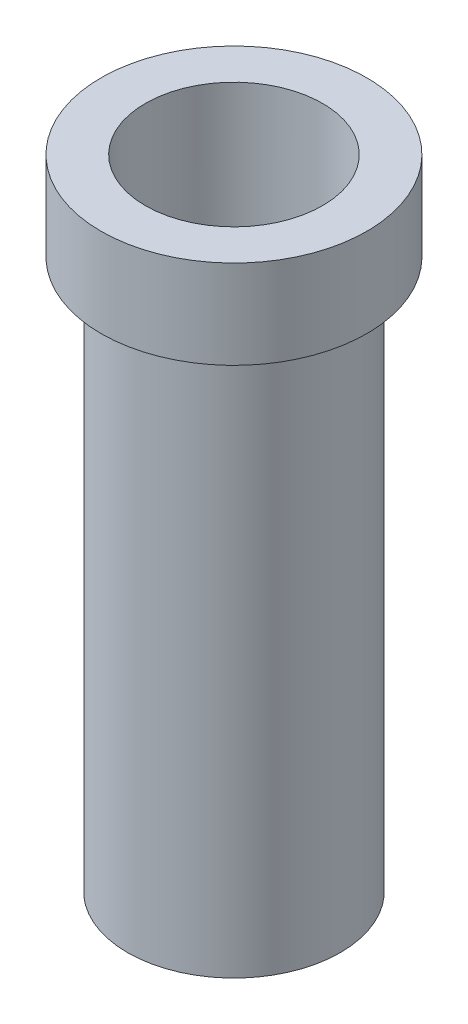
ISO-10303-21;
HEADER;
FILE_DESCRIPTION(('STEP AP214'),'2;1');
FILE_NAME('part.step','',(''),(''),'','','');
FILE_SCHEMA(('AUTOMOTIVE_DESIGN { 1 0 10303 214 1 1 1 1 }'));
ENDSEC;
DATA;
#1=APPLICATION_CONTEXT('core data for automotive mechanical design processes');
#2=APPLICATION_PROTOCOL_DEFINITION('international standard','automotive_design',2000,#1);
#3=PRODUCT_CONTEXT('',#1,'mechanical');
#4=PRODUCT('Part','Part','',(#3));
#5=PRODUCT_RELATED_PRODUCT_CATEGORY('part','',(#4));
#6=PRODUCT_DEFINITION_FORMATION('','',#4);
#7=PRODUCT_DEFINITION_CONTEXT('part definition',#1,'design');
#8=PRODUCT_DEFINITION('design','',#6,#7);
#9=PRODUCT_DEFINITION_SHAPE('','',#8);
#10=(LENGTH_UNIT() NAMED_UNIT(*) SI_UNIT(.MILLI.,.METRE.));
#11=(NAMED_UNIT(*) PLANE_ANGLE_UNIT() SI_UNIT($,.RADIAN.));
#12=(NAMED_UNIT(*) SI_UNIT($,.STERADIAN.) SOLID_ANGLE_UNIT());
#13=UNCERTAINTY_MEASURE_WITH_UNIT(LENGTH_MEASURE(1.E-05),#10,'distance_accuracy_value','');
#14=(GEOMETRIC_REPRESENTATION_CONTEXT(3) GLOBAL_UNCERTAINTY_ASSIGNED_CONTEXT((#13)) GLOBAL_UNIT_ASSIGNED_CONTEXT((#10,
#11,#12)) REPRESENTATION_CONTEXT('',''));
#15=CARTESIAN_POINT('',(0.,0.,0.));
#16=DIRECTION('',(0.,0.,1.));
#17=DIRECTION('',(1.,0.,0.));
#18=AXIS2_PLACEMENT_3D('',#15,#16,#17);
#19=CARTESIAN_POINT('',(0.,0.,0.));
#20=DIRECTION('',(0.,1.,0.));
#21=DIRECTION('',(0.,0.,1.));
#22=AXIS2_PLACEMENT_3D('',#19,#20,#21);
#23=PLANE('',#22);
#24=CARTESIAN_POINT('',(0.,0.,0.));
#25=DIRECTION('',(0.,1.,0.));
#26=DIRECTION('',(0.,0.,1.));
#27=AXIS2_PLACEMENT_3D('',#24,#25,#26);
#28=CIRCLE('',#27,7.5);
#29=CARTESIAN_POINT('',(0.,0.,7.5));
#30=VERTEX_POINT('',#29);
#31=EDGE_CURVE('E39',#30,#30,#28,.T.);
#32=ORIENTED_EDGE('',*,*,#31,.F.);
#33=EDGE_LOOP('',(#32));
#34=FACE_BOUND('',#33,.T.);
#35=CARTESIAN_POINT('',(0.,0.,0.));
#36=DIRECTION('',(0.,1.,0.));
#37=DIRECTION('',(0.,0.,1.));
#38=AXIS2_PLACEMENT_3D('',#35,#36,#37);
#39=CIRCLE('',#38,6.);
#40=CARTESIAN_POINT('',(0.,0.,6.));
#41=VERTEX_POINT('',#40);
#42=EDGE_CURVE('E10',#41,#41,#39,.F.);
#43=ORIENTED_EDGE('',*,*,#42,.F.);
#44=EDGE_LOOP('',(#43));
#45=FACE_BOUND('',#44,.T.);
#46=ADVANCED_FACE('F28',(#34,#45),#23,.F.);
#47=CARTESIAN_POINT('',(0.,5.,0.));
#48=DIRECTION('',(0.,-1.,0.));
#49=DIRECTION('',(0.,0.,-1.));
#50=AXIS2_PLACEMENT_3D('',#47,#48,#49);
#51=CYLINDRICAL_SURFACE('',#50,7.5);
#52=CARTESIAN_POINT('',(0.,5.,0.));
#53=DIRECTION('',(0.,1.,0.));
#54=DIRECTION('',(0.,0.,1.));
#55=AXIS2_PLACEMENT_3D('',#52,#53,#54);
#56=CIRCLE('',#55,7.5);
#57=CARTESIAN_POINT('',(0.,5.,7.5));
#58=VERTEX_POINT('',#57);
#59=EDGE_CURVE('E35',#58,#58,#56,.T.);
#60=ORIENTED_EDGE('',*,*,#59,.F.);
#61=EDGE_LOOP('',(#60));
#62=FACE_BOUND('',#61,.T.);
#63=ORIENTED_EDGE('',*,*,#31,.T.);
#64=EDGE_LOOP('',(#63));
#65=FACE_BOUND('',#64,.T.);
#66=ADVANCED_FACE('F30',(#62,#65),#51,.T.);
#67=CARTESIAN_POINT('',(0.,5.,0.));
#68=DIRECTION('',(0.,1.,0.));
#69=DIRECTION('',(0.,0.,1.));
#70=AXIS2_PLACEMENT_3D('',#67,#68,#69);
#71=PLANE('',#70);
#72=CARTESIAN_POINT('',(0.,5.,0.));
#73=DIRECTION('',(0.,1.,0.));
#74=DIRECTION('',(0.,0.,1.));
#75=AXIS2_PLACEMENT_3D('',#72,#73,#74);
#76=CIRCLE('',#75,5.);
#77=CARTESIAN_POINT('',(0.,5.,5.));
#78=VERTEX_POINT('',#77);
#79=EDGE_CURVE('E48',#78,#78,#76,.T.);
#80=ORIENTED_EDGE('',*,*,#79,.F.);
#81=EDGE_LOOP('',(#80));
#82=FACE_BOUND('',#81,.T.);
#83=ORIENTED_EDGE('',*,*,#59,.T.);
#84=EDGE_LOOP('',(#83));
#85=FACE_BOUND('',#84,.T.);
#86=ADVANCED_FACE('F57',(#82,#85),#71,.T.);
#87=CARTESIAN_POINT('',(0.,-31.,0.));
#88=DIRECTION('',(0.,1.,0.));
#89=DIRECTION('',(0.,0.,1.));
#90=AXIS2_PLACEMENT_3D('',#87,#88,#89);
#91=CYLINDRICAL_SURFACE('',#90,6.);
#92=CARTESIAN_POINT('',(0.,-31.,0.));
#93=DIRECTION('',(0.,-1.,0.));
#94=DIRECTION('',(0.,0.,-1.));
#95=AXIS2_PLACEMENT_3D('',#92,#93,#94);
#96=CIRCLE('',#95,6.);
#97=CARTESIAN_POINT('',(0.,-31.,-6.));
#98=VERTEX_POINT('',#97);
#99=EDGE_CURVE('E44',#98,#98,#96,.T.);
#100=ORIENTED_EDGE('',*,*,#99,.F.);
#101=EDGE_LOOP('',(#100));
#102=FACE_BOUND('',#101,.T.);
#103=ORIENTED_EDGE('',*,*,#42,.T.);
#104=EDGE_LOOP('',(#103));
#105=FACE_BOUND('',#104,.T.);
#106=ADVANCED_FACE('F59',(#102,#105),#91,.T.);
#107=CARTESIAN_POINT('',(0.,-31.,0.));
#108=DIRECTION('',(0.,-1.,0.));
#109=DIRECTION('',(0.,0.,-1.));
#110=AXIS2_PLACEMENT_3D('',#107,#108,#109);
#111=PLANE('',#110);
#112=CARTESIAN_POINT('',(0.,-31.,0.));
#113=DIRECTION('',(0.,-1.,0.));
#114=DIRECTION('',(0.,0.,-1.));
#115=AXIS2_PLACEMENT_3D('',#112,#113,#114);
#116=CIRCLE('',#115,5.);
#117=CARTESIAN_POINT('',(0.,-31.,-5.));
#118=VERTEX_POINT('',#117);
#119=EDGE_CURVE('E49',#118,#118,#116,.F.);
#120=ORIENTED_EDGE('',*,*,#119,.T.);
#121=EDGE_LOOP('',(#120));
#122=FACE_BOUND('',#121,.T.);
#123=ORIENTED_EDGE('',*,*,#99,.T.);
#124=EDGE_LOOP('',(#123));
#125=FACE_BOUND('',#124,.T.);
#126=ADVANCED_FACE('F65',(#122,#125),#111,.T.);
#127=CARTESIAN_POINT('',(0.,-31.001,0.));
#128=DIRECTION('',(0.,1.,0.));
#129=DIRECTION('',(0.,0.,1.));
#130=AXIS2_PLACEMENT_3D('',#127,#128,#129);
#131=CYLINDRICAL_SURFACE('',#130,5.);
#132=ORIENTED_EDGE('',*,*,#119,.F.);
#133=EDGE_LOOP('',(#132));
#134=FACE_BOUND('',#133,.T.);
#135=ORIENTED_EDGE('',*,*,#79,.T.);
#136=EDGE_LOOP('',(#135));
#137=FACE_BOUND('',#136,.T.);
#138=ADVANCED_FACE('F55',(#134,#137),#131,.F.);
#139=CLOSED_SHELL('',(#46,#66,#86,#106,#126,#138));
#140=MANIFOLD_SOLID_BREP('B2',#139);
#141=ADVANCED_BREP_SHAPE_REPRESENTATION('',(#18,#140),#14);
#142=SHAPE_DEFINITION_REPRESENTATION(#9,#141);
ENDSEC;
END-ISO-10303-21;
